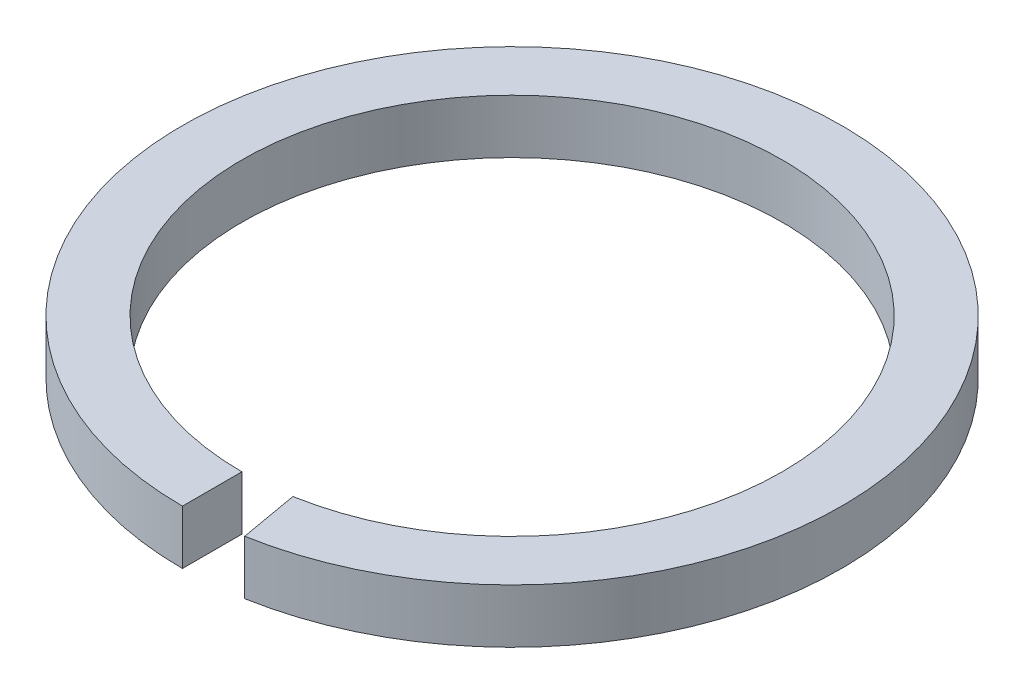
ISO-10303-21;
HEADER;
FILE_DESCRIPTION(('STEP AP214'),'2;1');
FILE_NAME('part.step','',(''),(''),'','','');
FILE_SCHEMA(('AUTOMOTIVE_DESIGN { 1 0 10303 214 1 1 1 1 }'));
ENDSEC;
DATA;
#1=APPLICATION_CONTEXT('core data for automotive mechanical design processes');
#2=APPLICATION_PROTOCOL_DEFINITION('international standard','automotive_design',2000,#1);
#3=PRODUCT_CONTEXT('',#1,'mechanical');
#4=PRODUCT('Part','Part','',(#3));
#5=PRODUCT_RELATED_PRODUCT_CATEGORY('part','',(#4));
#6=PRODUCT_DEFINITION_FORMATION('','',#4);
#7=PRODUCT_DEFINITION_CONTEXT('part definition',#1,'design');
#8=PRODUCT_DEFINITION('design','',#6,#7);
#9=PRODUCT_DEFINITION_SHAPE('','',#8);
#10=(LENGTH_UNIT() NAMED_UNIT(*) SI_UNIT(.MILLI.,.METRE.));
#11=(NAMED_UNIT(*) PLANE_ANGLE_UNIT() SI_UNIT($,.RADIAN.));
#12=(NAMED_UNIT(*) SI_UNIT($,.STERADIAN.) SOLID_ANGLE_UNIT());
#13=UNCERTAINTY_MEASURE_WITH_UNIT(LENGTH_MEASURE(1.E-05),#10,'distance_accuracy_value','');
#14=(GEOMETRIC_REPRESENTATION_CONTEXT(3) GLOBAL_UNCERTAINTY_ASSIGNED_CONTEXT((#13)) GLOBAL_UNIT_ASSIGNED_CONTEXT((#10,
#11,#12)) REPRESENTATION_CONTEXT('',''));
#15=CARTESIAN_POINT('',(0.,0.,0.));
#16=DIRECTION('',(0.,0.,1.));
#17=DIRECTION('',(1.,0.,0.));
#18=AXIS2_PLACEMENT_3D('',#15,#16,#17);
#19=CARTESIAN_POINT('',(0.,2.5,0.));
#20=DIRECTION('',(0.,1.,0.));
#21=DIRECTION('',(0.,0.,1.));
#22=AXIS2_PLACEMENT_3D('',#19,#20,#21);
#23=PLANE('',#22);
#24=DIRECTION('',(-0.173648177666931,0.,-0.984807753012208));
#25=VECTOR('',#24,1.);
#26=CARTESIAN_POINT('',(2.17060222083664,2.5,12.3100969126526));
#27=LINE('',#26,#25);
#28=CARTESIAN_POINT('',(2.6481347094207,2.5,15.0183182334362));
#29=VERTEX_POINT('',#28);
#30=CARTESIAN_POINT('',(2.17060222083664,2.5,12.3100969126526));
#31=VERTEX_POINT('',#30);
#32=EDGE_CURVE('E57',#29,#31,#27,.T.);
#33=ORIENTED_EDGE('',*,*,#32,.F.);
#34=CARTESIAN_POINT('',(0.,2.5,0.));
#35=DIRECTION('',(0.,1.,0.));
#36=DIRECTION('',(0.,0.,1.));
#37=AXIS2_PLACEMENT_3D('',#34,#35,#36);
#38=CIRCLE('',#37,15.25);
#39=CARTESIAN_POINT('',(0.,2.5,15.25));
#40=VERTEX_POINT('',#39);
#41=EDGE_CURVE('E11',#29,#40,#38,.T.);
#42=ORIENTED_EDGE('',*,*,#41,.T.);
#43=DIRECTION('',(0.,0.,1.));
#44=VECTOR('',#43,1.);
#45=CARTESIAN_POINT('',(0.,2.5,12.5));
#46=LINE('',#45,#44);
#47=CARTESIAN_POINT('',(0.,2.5,12.5));
#48=VERTEX_POINT('',#47);
#49=EDGE_CURVE('E76',#48,#40,#46,.T.);
#50=ORIENTED_EDGE('',*,*,#49,.F.);
#51=CARTESIAN_POINT('',(0.,2.5,0.));
#52=DIRECTION('',(0.,1.,0.));
#53=DIRECTION('',(0.,0.,1.));
#54=AXIS2_PLACEMENT_3D('',#51,#52,#53);
#55=CIRCLE('',#54,12.5);
#56=EDGE_CURVE('E93',#31,#48,#55,.T.);
#57=ORIENTED_EDGE('',*,*,#56,.F.);
#58=EDGE_LOOP('',(#33,#42,#50,#57));
#59=FACE_BOUND('',#58,.T.);
#60=ADVANCED_FACE('F34',(#59),#23,.T.);
#61=CARTESIAN_POINT('',(0.,0.,0.));
#62=DIRECTION('',(0.,1.,0.));
#63=DIRECTION('',(0.,0.,1.));
#64=AXIS2_PLACEMENT_3D('',#61,#62,#63);
#65=PLANE('',#64);
#66=CARTESIAN_POINT('',(0.,0.,0.));
#67=DIRECTION('',(0.,1.,0.));
#68=DIRECTION('',(0.,0.,1.));
#69=AXIS2_PLACEMENT_3D('',#66,#67,#68);
#70=CIRCLE('',#69,15.25);
#71=CARTESIAN_POINT('',(2.6481347094207,0.,15.0183182334362));
#72=VERTEX_POINT('',#71);
#73=CARTESIAN_POINT('',(0.,0.,15.25));
#74=VERTEX_POINT('',#73);
#75=EDGE_CURVE('E38',#72,#74,#70,.T.);
#76=ORIENTED_EDGE('',*,*,#75,.F.);
#77=DIRECTION('',(-0.173648177666931,0.,-0.984807753012208));
#78=VECTOR('',#77,1.);
#79=CARTESIAN_POINT('',(2.17060222083664,0.,12.3100969126526));
#80=LINE('',#79,#78);
#81=CARTESIAN_POINT('',(2.17060222083664,0.,12.3100969126526));
#82=VERTEX_POINT('',#81);
#83=EDGE_CURVE('E90',#72,#82,#80,.T.);
#84=ORIENTED_EDGE('',*,*,#83,.T.);
#85=CARTESIAN_POINT('',(0.,0.,0.));
#86=DIRECTION('',(0.,1.,0.));
#87=DIRECTION('',(0.,0.,1.));
#88=AXIS2_PLACEMENT_3D('',#85,#86,#87);
#89=CIRCLE('',#88,12.5);
#90=CARTESIAN_POINT('',(0.,0.,12.5));
#91=VERTEX_POINT('',#90);
#92=EDGE_CURVE('E89',#82,#91,#89,.T.);
#93=ORIENTED_EDGE('',*,*,#92,.T.);
#94=DIRECTION('',(0.,0.,1.));
#95=VECTOR('',#94,1.);
#96=CARTESIAN_POINT('',(0.,0.,12.5));
#97=LINE('',#96,#95);
#98=EDGE_CURVE('E49',#91,#74,#97,.T.);
#99=ORIENTED_EDGE('',*,*,#98,.T.);
#100=EDGE_LOOP('',(#76,#84,#93,#99));
#101=FACE_BOUND('',#100,.T.);
#102=ADVANCED_FACE('F86',(#101),#65,.F.);
#103=CARTESIAN_POINT('',(0.,2.5,0.));
#104=DIRECTION('',(0.,-1.,0.));
#105=DIRECTION('',(0.,0.,-1.));
#106=AXIS2_PLACEMENT_3D('',#103,#104,#105);
#107=CYLINDRICAL_SURFACE('',#106,15.25);
#108=ORIENTED_EDGE('',*,*,#41,.F.);
#109=DIRECTION('',(0.,1.,0.));
#110=VECTOR('',#109,1.);
#111=CARTESIAN_POINT('',(2.6481347094207,0.,15.0183182334362));
#112=LINE('',#111,#110);
#113=EDGE_CURVE('E80',#72,#29,#112,.T.);
#114=ORIENTED_EDGE('',*,*,#113,.F.);
#115=ORIENTED_EDGE('',*,*,#75,.T.);
#116=DIRECTION('',(0.,1.,0.));
#117=VECTOR('',#116,1.);
#118=CARTESIAN_POINT('',(0.,0.,15.25));
#119=LINE('',#118,#117);
#120=EDGE_CURVE('E73',#74,#40,#119,.T.);
#121=ORIENTED_EDGE('',*,*,#120,.T.);
#122=EDGE_LOOP('',(#108,#114,#115,#121));
#123=FACE_BOUND('',#122,.T.);
#124=ADVANCED_FACE('F36',(#123),#107,.T.);
#125=CARTESIAN_POINT('',(0.,2.5,0.));
#126=DIRECTION('',(0.,-1.,0.));
#127=DIRECTION('',(0.,0.,-1.));
#128=AXIS2_PLACEMENT_3D('',#125,#126,#127);
#129=CYLINDRICAL_SURFACE('',#128,12.5);
#130=DIRECTION('',(0.,1.,0.));
#131=VECTOR('',#130,1.);
#132=CARTESIAN_POINT('',(2.17060222083664,0.,12.3100969126526));
#133=LINE('',#132,#131);
#134=EDGE_CURVE('E98',#82,#31,#133,.T.);
#135=ORIENTED_EDGE('',*,*,#134,.T.);
#136=ORIENTED_EDGE('',*,*,#56,.T.);
#137=DIRECTION('',(0.,1.,0.));
#138=VECTOR('',#137,1.);
#139=CARTESIAN_POINT('',(0.,0.,12.5));
#140=LINE('',#139,#138);
#141=EDGE_CURVE('E81',#91,#48,#140,.T.);
#142=ORIENTED_EDGE('',*,*,#141,.F.);
#143=ORIENTED_EDGE('',*,*,#92,.F.);
#144=EDGE_LOOP('',(#135,#136,#142,#143));
#145=FACE_BOUND('',#144,.T.);
#146=ADVANCED_FACE('F106',(#145),#129,.F.);
#147=CARTESIAN_POINT('',(0.,0.,12.5));
#148=DIRECTION('',(-1.,0.,0.));
#149=DIRECTION('',(0.,0.,1.));
#150=AXIS2_PLACEMENT_3D('',#147,#148,#149);
#151=PLANE('',#150);
#152=ORIENTED_EDGE('',*,*,#49,.T.);
#153=ORIENTED_EDGE('',*,*,#120,.F.);
#154=ORIENTED_EDGE('',*,*,#98,.F.);
#155=ORIENTED_EDGE('',*,*,#141,.T.);
#156=EDGE_LOOP('',(#152,#153,#154,#155));
#157=FACE_BOUND('',#156,.T.);
#158=ADVANCED_FACE('F74',(#157),#151,.F.);
#159=CARTESIAN_POINT('',(2.17060222083664,0.,12.3100969126526));
#160=DIRECTION('',(0.984807753012208,0.,-0.173648177666931));
#161=DIRECTION('',(-0.173648177666931,0.,-0.984807753012208));
#162=AXIS2_PLACEMENT_3D('',#159,#160,#161);
#163=PLANE('',#162);
#164=ORIENTED_EDGE('',*,*,#32,.T.);
#165=ORIENTED_EDGE('',*,*,#134,.F.);
#166=ORIENTED_EDGE('',*,*,#83,.F.);
#167=ORIENTED_EDGE('',*,*,#113,.T.);
#168=EDGE_LOOP('',(#164,#165,#166,#167));
#169=FACE_BOUND('',#168,.T.);
#170=ADVANCED_FACE('F118',(#169),#163,.F.);
#171=CLOSED_SHELL('',(#60,#102,#124,#146,#158,#170));
#172=MANIFOLD_SOLID_BREP('B2',#171);
#173=ADVANCED_BREP_SHAPE_REPRESENTATION('',(#18,#172),#14);
#174=SHAPE_DEFINITION_REPRESENTATION(#9,#173);
ENDSEC;
END-ISO-10303-21;
